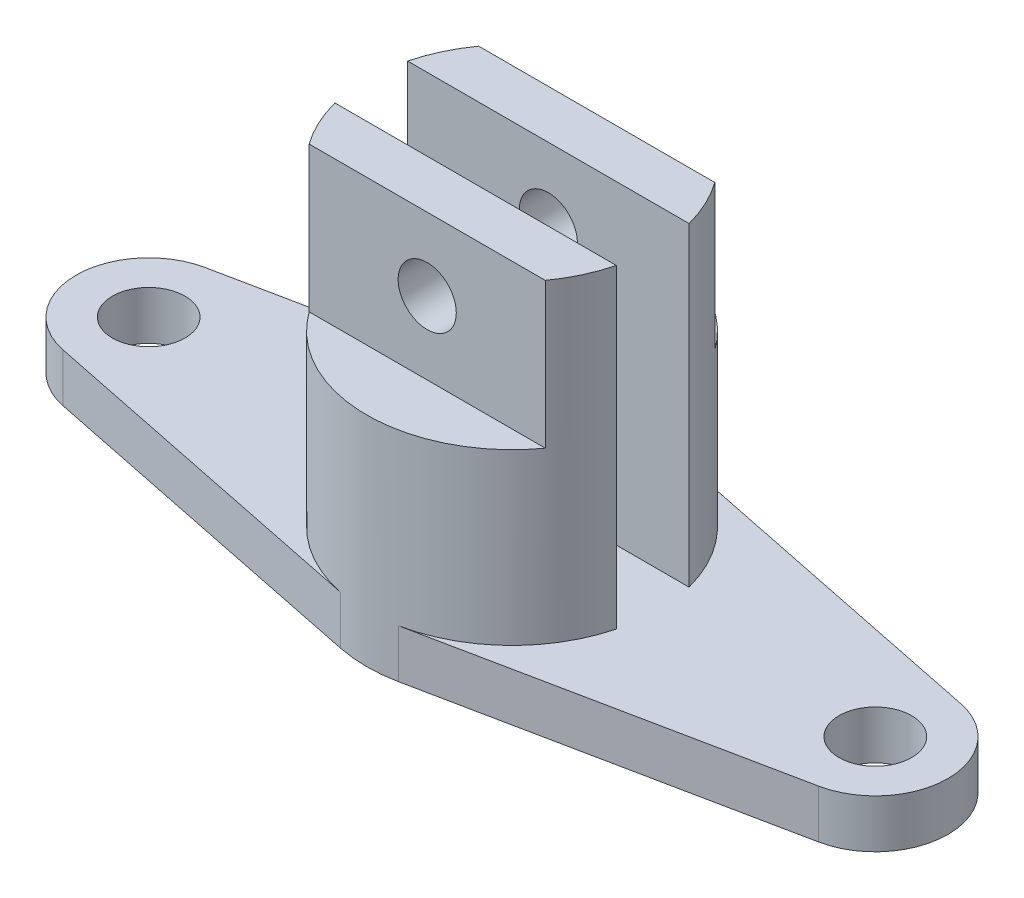
ISO-10303-21;
HEADER;
FILE_DESCRIPTION(('STEP AP214'),'2;1');
FILE_NAME('part.step','',(''),(''),'','','');
FILE_SCHEMA(('AUTOMOTIVE_DESIGN { 1 0 10303 214 1 1 1 1 }'));
ENDSEC;
DATA;
#1=APPLICATION_CONTEXT('core data for automotive mechanical design processes');
#2=APPLICATION_PROTOCOL_DEFINITION('international standard','automotive_design',2000,#1);
#3=PRODUCT_CONTEXT('',#1,'mechanical');
#4=PRODUCT('Part','Part','',(#3));
#5=PRODUCT_RELATED_PRODUCT_CATEGORY('part','',(#4));
#6=PRODUCT_DEFINITION_FORMATION('','',#4);
#7=PRODUCT_DEFINITION_CONTEXT('part definition',#1,'design');
#8=PRODUCT_DEFINITION('design','',#6,#7);
#9=PRODUCT_DEFINITION_SHAPE('','',#8);
#10=(LENGTH_UNIT() NAMED_UNIT(*) SI_UNIT(.MILLI.,.METRE.));
#11=(NAMED_UNIT(*) PLANE_ANGLE_UNIT() SI_UNIT($,.RADIAN.));
#12=(NAMED_UNIT(*) SI_UNIT($,.STERADIAN.) SOLID_ANGLE_UNIT());
#13=UNCERTAINTY_MEASURE_WITH_UNIT(LENGTH_MEASURE(1.E-05),#10,'distance_accuracy_value','');
#14=(GEOMETRIC_REPRESENTATION_CONTEXT(3) GLOBAL_UNCERTAINTY_ASSIGNED_CONTEXT((#13)) GLOBAL_UNIT_ASSIGNED_CONTEXT((#10,
#11,#12)) REPRESENTATION_CONTEXT('',''));
#15=CARTESIAN_POINT('',(0.,0.,0.));
#16=DIRECTION('',(0.,0.,1.));
#17=DIRECTION('',(1.,0.,0.));
#18=AXIS2_PLACEMENT_3D('',#15,#16,#17);
#19=CARTESIAN_POINT('',(0.,1905.,0.));
#20=DIRECTION('',(0.,-1.,0.));
#21=DIRECTION('',(0.,0.,-1.));
#22=AXIS2_PLACEMENT_3D('',#19,#20,#21);
#23=CYLINDRICAL_SURFACE('',#22,762.);
#24=DIRECTION('',(0.,-1.,0.));
#25=VECTOR('',#24,1.);
#26=CARTESIAN_POINT('',(152.4,254.,746.604473600313));
#27=LINE('',#26,#25);
#28=CARTESIAN_POINT('',(152.4,254.,746.604473600313));
#29=VERTEX_POINT('',#28);
#30=CARTESIAN_POINT('',(152.4,0.,746.604473600313));
#31=VERTEX_POINT('',#30);
#32=EDGE_CURVE('E60',#29,#31,#27,.T.);
#33=ORIENTED_EDGE('',*,*,#32,.F.);
#34=CARTESIAN_POINT('',(0.,254.,0.));
#35=DIRECTION('',(0.,1.,0.));
#36=DIRECTION('',(0.,0.,1.));
#37=AXIS2_PLACEMENT_3D('',#34,#35,#36);
#38=CIRCLE('',#37,762.);
#39=CARTESIAN_POINT('',(737.803327452513,254.,190.5));
#40=VERTEX_POINT('',#39);
#41=EDGE_CURVE('E215',#29,#40,#38,.T.);
#42=ORIENTED_EDGE('',*,*,#41,.T.);
#43=DIRECTION('',(0.,-1.,0.));
#44=VECTOR('',#43,1.);
#45=CARTESIAN_POINT('',(737.803327452513,1905.,190.5));
#46=LINE('',#45,#44);
#47=CARTESIAN_POINT('',(737.803327452513,1905.,190.5));
#48=VERTEX_POINT('',#47);
#49=EDGE_CURVE('E53',#48,#40,#46,.T.);
#50=ORIENTED_EDGE('',*,*,#49,.F.);
#51=CARTESIAN_POINT('',(0.,1905.,0.));
#52=DIRECTION('',(0.,1.,0.));
#53=DIRECTION('',(0.,0.,1.));
#54=AXIS2_PLACEMENT_3D('',#51,#52,#53);
#55=CIRCLE('',#54,762.);
#56=CARTESIAN_POINT('',(618.921440895369,1905.,444.5));
#57=VERTEX_POINT('',#56);
#58=EDGE_CURVE('E303',#57,#48,#55,.T.);
#59=ORIENTED_EDGE('',*,*,#58,.F.);
#60=DIRECTION('',(0.,-1.,0.));
#61=VECTOR('',#60,1.);
#62=CARTESIAN_POINT('',(618.921440895369,1905.,444.5));
#63=LINE('',#62,#61);
#64=CARTESIAN_POINT('',(618.921440895369,1143.,444.5));
#65=VERTEX_POINT('',#64);
#66=EDGE_CURVE('E11',#57,#65,#63,.T.);
#67=ORIENTED_EDGE('',*,*,#66,.T.);
#68=CARTESIAN_POINT('',(0.,1143.,0.));
#69=DIRECTION('',(0.,1.,0.));
#70=DIRECTION('',(0.,0.,1.));
#71=AXIS2_PLACEMENT_3D('',#68,#69,#70);
#72=CIRCLE('',#71,762.);
#73=CARTESIAN_POINT('',(-618.921440895369,1143.,444.5));
#74=VERTEX_POINT('',#73);
#75=EDGE_CURVE('E291',#74,#65,#72,.T.);
#76=ORIENTED_EDGE('',*,*,#75,.F.);
#77=DIRECTION('',(0.,-1.,0.));
#78=VECTOR('',#77,1.);
#79=CARTESIAN_POINT('',(-618.921440895369,1905.,444.5));
#80=LINE('',#79,#78);
#81=CARTESIAN_POINT('',(-618.921440895369,1905.,444.5));
#82=VERTEX_POINT('',#81);
#83=EDGE_CURVE('E313',#82,#74,#80,.T.);
#84=ORIENTED_EDGE('',*,*,#83,.F.);
#85=CARTESIAN_POINT('',(-737.803327452513,1905.,190.5));
#86=VERTEX_POINT('',#85);
#87=EDGE_CURVE('E307',#86,#82,#55,.T.);
#88=ORIENTED_EDGE('',*,*,#87,.F.);
#89=DIRECTION('',(0.,-1.,0.));
#90=VECTOR('',#89,1.);
#91=CARTESIAN_POINT('',(-737.803327452513,1905.,190.5));
#92=LINE('',#91,#90);
#93=CARTESIAN_POINT('',(-737.803327452513,254.,190.5));
#94=VERTEX_POINT('',#93);
#95=EDGE_CURVE('E316',#86,#94,#92,.T.);
#96=ORIENTED_EDGE('',*,*,#95,.T.);
#97=CARTESIAN_POINT('',(-152.4,254.,746.604473600313));
#98=VERTEX_POINT('',#97);
#99=EDGE_CURVE('E67',#94,#98,#38,.T.);
#100=ORIENTED_EDGE('',*,*,#99,.T.);
#101=DIRECTION('',(0.,-1.,0.));
#102=VECTOR('',#101,1.);
#103=CARTESIAN_POINT('',(-152.4,254.,746.604473600313));
#104=LINE('',#103,#102);
#105=CARTESIAN_POINT('',(-152.4,0.,746.604473600313));
#106=VERTEX_POINT('',#105);
#107=EDGE_CURVE('E277',#98,#106,#104,.T.);
#108=ORIENTED_EDGE('',*,*,#107,.T.);
#109=CARTESIAN_POINT('',(0.,0.,0.));
#110=DIRECTION('',(0.,1.,0.));
#111=DIRECTION('',(0.,0.,1.));
#112=AXIS2_PLACEMENT_3D('',#109,#110,#111);
#113=CIRCLE('',#112,762.);
#114=EDGE_CURVE('E298',#106,#31,#113,.T.);
#115=ORIENTED_EDGE('',*,*,#114,.T.);
#116=EDGE_LOOP('',(#33,#42,#50,#59,#67,#76,#84,#88,#96,#100,#108,#115));
#117=FACE_BOUND('',#116,.T.);
#118=ADVANCED_FACE('F43',(#117),#23,.T.);
#119=CARTESIAN_POINT('',(0.,1905.,444.5));
#120=DIRECTION('',(0.,0.,-1.));
#121=DIRECTION('',(-1.,0.,0.));
#122=AXIS2_PLACEMENT_3D('',#119,#120,#121);
#123=PLANE('',#122);
#124=CARTESIAN_POINT('',(0.,1524.,444.5));
#125=DIRECTION('',(0.,0.,1.));
#126=DIRECTION('',(1.,0.,0.));
#127=AXIS2_PLACEMENT_3D('',#124,#125,#126);
#128=CIRCLE('',#127,152.4);
#129=CARTESIAN_POINT('',(152.4,1524.,444.5));
#130=VERTEX_POINT('',#129);
#131=EDGE_CURVE('E664',#130,#130,#128,.T.);
#132=ORIENTED_EDGE('',*,*,#131,.F.);
#133=EDGE_LOOP('',(#132));
#134=FACE_BOUND('',#133,.T.);
#135=ORIENTED_EDGE('',*,*,#83,.T.);
#136=DIRECTION('',(1.,0.,0.));
#137=VECTOR('',#136,1.);
#138=CARTESIAN_POINT('',(0.,1143.,444.5));
#139=LINE('',#138,#137);
#140=EDGE_CURVE('E295',#74,#65,#139,.T.);
#141=ORIENTED_EDGE('',*,*,#140,.T.);
#142=ORIENTED_EDGE('',*,*,#66,.F.);
#143=DIRECTION('',(1.,0.,0.));
#144=VECTOR('',#143,1.);
#145=CARTESIAN_POINT('',(0.,1905.,444.5));
#146=LINE('',#145,#144);
#147=EDGE_CURVE('E299',#82,#57,#146,.T.);
#148=ORIENTED_EDGE('',*,*,#147,.F.);
#149=EDGE_LOOP('',(#135,#141,#142,#148));
#150=FACE_BOUND('',#149,.T.);
#151=ADVANCED_FACE('F45',(#134,#150),#123,.F.);
#152=CARTESIAN_POINT('',(0.,1905.,190.5));
#153=DIRECTION('',(0.,0.,-1.));
#154=DIRECTION('',(-1.,0.,0.));
#155=AXIS2_PLACEMENT_3D('',#152,#153,#154);
#156=PLANE('',#155);
#157=CARTESIAN_POINT('',(0.,1524.,190.5));
#158=DIRECTION('',(0.,0.,-1.));
#159=DIRECTION('',(-1.,0.,0.));
#160=AXIS2_PLACEMENT_3D('',#157,#158,#159);
#161=CIRCLE('',#160,152.4);
#162=CARTESIAN_POINT('',(-152.4,1524.,190.5));
#163=VERTEX_POINT('',#162);
#164=EDGE_CURVE('E176',#163,#163,#161,.T.);
#165=ORIENTED_EDGE('',*,*,#164,.F.);
#166=EDGE_LOOP('',(#165));
#167=FACE_BOUND('',#166,.T.);
#168=DIRECTION('',(1.,0.,0.));
#169=VECTOR('',#168,1.);
#170=CARTESIAN_POINT('',(0.,254.,190.5));
#171=LINE('',#170,#169);
#172=EDGE_CURVE('E214',#94,#40,#171,.T.);
#173=ORIENTED_EDGE('',*,*,#172,.F.);
#174=ORIENTED_EDGE('',*,*,#95,.F.);
#175=DIRECTION('',(1.,0.,0.));
#176=VECTOR('',#175,1.);
#177=CARTESIAN_POINT('',(0.,1905.,190.5));
#178=LINE('',#177,#176);
#179=EDGE_CURVE('E306',#86,#48,#178,.T.);
#180=ORIENTED_EDGE('',*,*,#179,.T.);
#181=ORIENTED_EDGE('',*,*,#49,.T.);
#182=EDGE_LOOP('',(#173,#174,#180,#181));
#183=FACE_BOUND('',#182,.T.);
#184=ADVANCED_FACE('F323',(#167,#183),#156,.T.);
#185=CARTESIAN_POINT('',(0.,1905.,0.));
#186=DIRECTION('',(0.,1.,0.));
#187=DIRECTION('',(0.,0.,1.));
#188=AXIS2_PLACEMENT_3D('',#185,#186,#187);
#189=PLANE('',#188);
#190=ORIENTED_EDGE('',*,*,#147,.T.);
#191=ORIENTED_EDGE('',*,*,#58,.T.);
#192=ORIENTED_EDGE('',*,*,#179,.F.);
#193=ORIENTED_EDGE('',*,*,#87,.T.);
#194=EDGE_LOOP('',(#190,#191,#192,#193));
#195=FACE_BOUND('',#194,.T.);
#196=ADVANCED_FACE('F372',(#195),#189,.T.);
#197=CARTESIAN_POINT('',(0.,0.,0.));
#198=DIRECTION('',(0.,1.,0.));
#199=DIRECTION('',(0.,0.,1.));
#200=AXIS2_PLACEMENT_3D('',#197,#198,#199);
#201=PLANE('',#200);
#202=CARTESIAN_POINT('',(0.,0.,0.));
#203=DIRECTION('',(0.,1.,0.));
#204=DIRECTION('',(0.,0.,1.));
#205=AXIS2_PLACEMENT_3D('',#202,#203,#204);
#206=CIRCLE('',#205,762.);
#207=CARTESIAN_POINT('',(152.4,0.,-746.604473600313));
#208=VERTEX_POINT('',#207);
#209=CARTESIAN_POINT('',(-152.4,0.,-746.604473600312));
#210=VERTEX_POINT('',#209);
#211=EDGE_CURVE('E170',#208,#210,#206,.T.);
#212=ORIENTED_EDGE('',*,*,#211,.F.);
#213=DIRECTION('',(0.979795897113271,0.,0.199999999999999));
#214=VECTOR('',#213,1.);
#215=CARTESIAN_POINT('',(152.4,0.,-746.604473600313));
#216=LINE('',#215,#214);
#217=CARTESIAN_POINT('',(1981.2,0.,-373.302236800158));
#218=VERTEX_POINT('',#217);
#219=EDGE_CURVE('E254',#208,#218,#216,.T.);
#220=ORIENTED_EDGE('',*,*,#219,.T.);
#221=CARTESIAN_POINT('',(1905.,0.,0.));
#222=DIRECTION('',(0.,1.,0.));
#223=DIRECTION('',(0.,0.,1.));
#224=AXIS2_PLACEMENT_3D('',#221,#222,#223);
#225=CIRCLE('',#224,381.000000000001);
#226=CARTESIAN_POINT('',(1981.2,0.,373.302236800156));
#227=VERTEX_POINT('',#226);
#228=EDGE_CURVE('E250',#227,#218,#225,.T.);
#229=ORIENTED_EDGE('',*,*,#228,.F.);
#230=DIRECTION('',(0.979795897113271,0.,-0.2));
#231=VECTOR('',#230,1.);
#232=CARTESIAN_POINT('',(152.4,0.,746.604473600313));
#233=LINE('',#232,#231);
#234=EDGE_CURVE('E247',#31,#227,#233,.T.);
#235=ORIENTED_EDGE('',*,*,#234,.F.);
#236=ORIENTED_EDGE('',*,*,#114,.F.);
#237=DIRECTION('',(0.979795897113271,0.,0.2));
#238=VECTOR('',#237,1.);
#239=CARTESIAN_POINT('',(-152.4,0.,746.604473600313));
#240=LINE('',#239,#238);
#241=CARTESIAN_POINT('',(-1981.2,0.,373.302236800156));
#242=VERTEX_POINT('',#241);
#243=EDGE_CURVE('E243',#242,#106,#240,.T.);
#244=ORIENTED_EDGE('',*,*,#243,.F.);
#245=CARTESIAN_POINT('',(-1905.,0.,0.));
#246=DIRECTION('',(0.,1.,0.));
#247=DIRECTION('',(0.,0.,1.));
#248=AXIS2_PLACEMENT_3D('',#245,#246,#247);
#249=CIRCLE('',#248,381.);
#250=CARTESIAN_POINT('',(-1981.2,0.,-373.302236800156));
#251=VERTEX_POINT('',#250);
#252=EDGE_CURVE('E240',#251,#242,#249,.T.);
#253=ORIENTED_EDGE('',*,*,#252,.F.);
#254=DIRECTION('',(-0.979795897113271,0.,0.2));
#255=VECTOR('',#254,1.);
#256=CARTESIAN_POINT('',(-152.4,0.,-746.604473600312));
#257=LINE('',#256,#255);
#258=EDGE_CURVE('E187',#210,#251,#257,.T.);
#259=ORIENTED_EDGE('',*,*,#258,.F.);
#260=EDGE_LOOP('',(#212,#220,#229,#235,#236,#244,#253,#259));
#261=FACE_BOUND('',#260,.T.);
#262=CARTESIAN_POINT('',(-1905.,0.,0.));
#263=DIRECTION('',(0.,1.,0.));
#264=DIRECTION('',(0.,0.,1.));
#265=AXIS2_PLACEMENT_3D('',#262,#263,#264);
#266=CIRCLE('',#265,190.5);
#267=CARTESIAN_POINT('',(-1905.,0.,190.5));
#268=VERTEX_POINT('',#267);
#269=EDGE_CURVE('E258',#268,#268,#266,.T.);
#270=ORIENTED_EDGE('',*,*,#269,.T.);
#271=EDGE_LOOP('',(#270));
#272=FACE_BOUND('',#271,.T.);
#273=CARTESIAN_POINT('',(1905.,0.,0.));
#274=DIRECTION('',(0.,1.,0.));
#275=DIRECTION('',(0.,0.,1.));
#276=AXIS2_PLACEMENT_3D('',#273,#274,#275);
#277=CIRCLE('',#276,190.499999999998);
#278=CARTESIAN_POINT('',(1905.,0.,190.499999999998));
#279=VERTEX_POINT('',#278);
#280=EDGE_CURVE('E198',#279,#279,#277,.T.);
#281=ORIENTED_EDGE('',*,*,#280,.T.);
#282=EDGE_LOOP('',(#281));
#283=FACE_BOUND('',#282,.T.);
#284=ADVANCED_FACE('F340',(#261,#272,#283),#201,.F.);
#285=CARTESIAN_POINT('',(0.,1143.,0.));
#286=DIRECTION('',(0.,1.,0.));
#287=DIRECTION('',(0.,0.,1.));
#288=AXIS2_PLACEMENT_3D('',#285,#286,#287);
#289=PLANE('',#288);
#290=ORIENTED_EDGE('',*,*,#75,.T.);
#291=ORIENTED_EDGE('',*,*,#140,.F.);
#292=EDGE_LOOP('',(#290,#291));
#293=FACE_BOUND('',#292,.T.);
#294=ADVANCED_FACE('F379',(#293),#289,.T.);
#295=CARTESIAN_POINT('',(-152.4,254.,-746.604473600312));
#296=DIRECTION('',(0.2,0.,0.979795897113271));
#297=DIRECTION('',(0.979795897113271,0.,-0.2));
#298=AXIS2_PLACEMENT_3D('',#295,#296,#297);
#299=PLANE('',#298);
#300=ORIENTED_EDGE('',*,*,#258,.T.);
#301=DIRECTION('',(0.,-1.,0.));
#302=VECTOR('',#301,1.);
#303=CARTESIAN_POINT('',(-1981.2,254.,-373.302236800156));
#304=LINE('',#303,#302);
#305=CARTESIAN_POINT('',(-1981.2,254.,-373.302236800156));
#306=VERTEX_POINT('',#305);
#307=EDGE_CURVE('E284',#306,#251,#304,.T.);
#308=ORIENTED_EDGE('',*,*,#307,.F.);
#309=DIRECTION('',(-0.979795897113271,0.,0.2));
#310=VECTOR('',#309,1.);
#311=CARTESIAN_POINT('',(-152.4,254.,-746.604473600312));
#312=LINE('',#311,#310);
#313=CARTESIAN_POINT('',(-152.4,254.,-746.604473600312));
#314=VERTEX_POINT('',#313);
#315=EDGE_CURVE('E203',#314,#306,#312,.T.);
#316=ORIENTED_EDGE('',*,*,#315,.F.);
#317=DIRECTION('',(0.,-1.,0.));
#318=VECTOR('',#317,1.);
#319=CARTESIAN_POINT('',(-152.4,254.,-746.604473600312));
#320=LINE('',#319,#318);
#321=EDGE_CURVE('E288',#314,#210,#320,.T.);
#322=ORIENTED_EDGE('',*,*,#321,.T.);
#323=EDGE_LOOP('',(#300,#308,#316,#322));
#324=FACE_BOUND('',#323,.T.);
#325=ADVANCED_FACE('F381',(#324),#299,.F.);
#326=CARTESIAN_POINT('',(-1905.,254.,0.));
#327=DIRECTION('',(0.,-1.,0.));
#328=DIRECTION('',(0.,0.,-1.));
#329=AXIS2_PLACEMENT_3D('',#326,#327,#328);
#330=CYLINDRICAL_SURFACE('',#329,381.);
#331=ORIENTED_EDGE('',*,*,#252,.T.);
#332=DIRECTION('',(0.,-1.,0.));
#333=VECTOR('',#332,1.);
#334=CARTESIAN_POINT('',(-1981.2,254.,373.302236800156));
#335=LINE('',#334,#333);
#336=CARTESIAN_POINT('',(-1981.2,254.,373.302236800156));
#337=VERTEX_POINT('',#336);
#338=EDGE_CURVE('E280',#337,#242,#335,.T.);
#339=ORIENTED_EDGE('',*,*,#338,.F.);
#340=CARTESIAN_POINT('',(-1905.,254.,0.));
#341=DIRECTION('',(0.,1.,0.));
#342=DIRECTION('',(0.,0.,1.));
#343=AXIS2_PLACEMENT_3D('',#340,#341,#342);
#344=CIRCLE('',#343,381.);
#345=EDGE_CURVE('E206',#306,#337,#344,.T.);
#346=ORIENTED_EDGE('',*,*,#345,.F.);
#347=ORIENTED_EDGE('',*,*,#307,.T.);
#348=EDGE_LOOP('',(#331,#339,#346,#347));
#349=FACE_BOUND('',#348,.T.);
#350=ADVANCED_FACE('F387',(#349),#330,.T.);
#351=CARTESIAN_POINT('',(-152.4,254.,746.604473600313));
#352=DIRECTION('',(0.2,0.,-0.979795897113271));
#353=DIRECTION('',(-0.979795897113271,0.,-0.2));
#354=AXIS2_PLACEMENT_3D('',#351,#352,#353);
#355=PLANE('',#354);
#356=ORIENTED_EDGE('',*,*,#243,.T.);
#357=ORIENTED_EDGE('',*,*,#107,.F.);
#358=DIRECTION('',(0.979795897113271,0.,0.2));
#359=VECTOR('',#358,1.);
#360=CARTESIAN_POINT('',(-152.4,254.,746.604473600313));
#361=LINE('',#360,#359);
#362=EDGE_CURVE('E209',#337,#98,#361,.T.);
#363=ORIENTED_EDGE('',*,*,#362,.F.);
#364=ORIENTED_EDGE('',*,*,#338,.T.);
#365=EDGE_LOOP('',(#356,#357,#363,#364));
#366=FACE_BOUND('',#365,.T.);
#367=ADVANCED_FACE('F334',(#366),#355,.F.);
#368=CARTESIAN_POINT('',(152.4,254.,746.604473600313));
#369=DIRECTION('',(-0.2,0.,-0.979795897113271));
#370=DIRECTION('',(-0.979795897113271,0.,0.2));
#371=AXIS2_PLACEMENT_3D('',#368,#369,#370);
#372=PLANE('',#371);
#373=ORIENTED_EDGE('',*,*,#234,.T.);
#374=DIRECTION('',(0.,-1.,0.));
#375=VECTOR('',#374,1.);
#376=CARTESIAN_POINT('',(1981.2,254.,373.302236800156));
#377=LINE('',#376,#375);
#378=CARTESIAN_POINT('',(1981.2,254.,373.302236800156));
#379=VERTEX_POINT('',#378);
#380=EDGE_CURVE('E271',#379,#227,#377,.T.);
#381=ORIENTED_EDGE('',*,*,#380,.F.);
#382=DIRECTION('',(0.979795897113271,0.,-0.2));
#383=VECTOR('',#382,1.);
#384=CARTESIAN_POINT('',(152.4,254.,746.604473600313));
#385=LINE('',#384,#383);
#386=EDGE_CURVE('E219',#29,#379,#385,.T.);
#387=ORIENTED_EDGE('',*,*,#386,.F.);
#388=ORIENTED_EDGE('',*,*,#32,.T.);
#389=EDGE_LOOP('',(#373,#381,#387,#388));
#390=FACE_BOUND('',#389,.T.);
#391=ADVANCED_FACE('F346',(#390),#372,.F.);
#392=CARTESIAN_POINT('',(1905.,254.,0.));
#393=DIRECTION('',(0.,-1.,0.));
#394=DIRECTION('',(0.,0.,-1.));
#395=AXIS2_PLACEMENT_3D('',#392,#393,#394);
#396=CYLINDRICAL_SURFACE('',#395,381.000000000001);
#397=ORIENTED_EDGE('',*,*,#228,.T.);
#398=DIRECTION('',(0.,-1.,0.));
#399=VECTOR('',#398,1.);
#400=CARTESIAN_POINT('',(1981.2,254.,-373.302236800158));
#401=LINE('',#400,#399);
#402=CARTESIAN_POINT('',(1981.2,254.,-373.302236800158));
#403=VERTEX_POINT('',#402);
#404=EDGE_CURVE('E268',#403,#218,#401,.T.);
#405=ORIENTED_EDGE('',*,*,#404,.F.);
#406=CARTESIAN_POINT('',(1905.,254.,0.));
#407=DIRECTION('',(0.,1.,0.));
#408=DIRECTION('',(0.,0.,1.));
#409=AXIS2_PLACEMENT_3D('',#406,#407,#408);
#410=CIRCLE('',#409,381.000000000001);
#411=EDGE_CURVE('E222',#379,#403,#410,.T.);
#412=ORIENTED_EDGE('',*,*,#411,.F.);
#413=ORIENTED_EDGE('',*,*,#380,.T.);
#414=EDGE_LOOP('',(#397,#405,#412,#413));
#415=FACE_BOUND('',#414,.T.);
#416=ADVANCED_FACE('F349',(#415),#396,.T.);
#417=CARTESIAN_POINT('',(-1905.,254.,0.));
#418=DIRECTION('',(0.,-1.,0.));
#419=DIRECTION('',(0.,0.,-1.));
#420=AXIS2_PLACEMENT_3D('',#417,#418,#419);
#421=CYLINDRICAL_SURFACE('',#420,190.5);
#422=CARTESIAN_POINT('',(-1905.,254.,0.));
#423=DIRECTION('',(0.,1.,0.));
#424=DIRECTION('',(0.,0.,1.));
#425=AXIS2_PLACEMENT_3D('',#422,#423,#424);
#426=CIRCLE('',#425,190.5);
#427=CARTESIAN_POINT('',(-1905.,254.,190.5));
#428=VERTEX_POINT('',#427);
#429=EDGE_CURVE('E229',#428,#428,#426,.T.);
#430=ORIENTED_EDGE('',*,*,#429,.T.);
#431=EDGE_LOOP('',(#430));
#432=FACE_BOUND('',#431,.T.);
#433=ORIENTED_EDGE('',*,*,#269,.F.);
#434=EDGE_LOOP('',(#433));
#435=FACE_BOUND('',#434,.T.);
#436=ADVANCED_FACE('F449',(#432,#435),#421,.F.);
#437=CARTESIAN_POINT('',(152.4,254.,-746.604473600313));
#438=DIRECTION('',(0.199999999999999,0.,-0.979795897113271));
#439=DIRECTION('',(-0.979795897113271,0.,-0.199999999999999));
#440=AXIS2_PLACEMENT_3D('',#437,#438,#439);
#441=PLANE('',#440);
#442=ORIENTED_EDGE('',*,*,#219,.F.);
#443=DIRECTION('',(0.,-1.,0.));
#444=VECTOR('',#443,1.);
#445=CARTESIAN_POINT('',(152.4,254.,-746.604473600313));
#446=LINE('',#445,#444);
#447=CARTESIAN_POINT('',(152.399999999999,254.,-746.604473600313));
#448=VERTEX_POINT('',#447);
#449=EDGE_CURVE('E237',#448,#208,#446,.T.);
#450=ORIENTED_EDGE('',*,*,#449,.F.);
#451=DIRECTION('',(0.979795897113271,0.,0.199999999999999));
#452=VECTOR('',#451,1.);
#453=CARTESIAN_POINT('',(152.4,254.,-746.604473600313));
#454=LINE('',#453,#452);
#455=EDGE_CURVE('E225',#448,#403,#454,.T.);
#456=ORIENTED_EDGE('',*,*,#455,.T.);
#457=ORIENTED_EDGE('',*,*,#404,.T.);
#458=EDGE_LOOP('',(#442,#450,#456,#457));
#459=FACE_BOUND('',#458,.T.);
#460=ADVANCED_FACE('F353',(#459),#441,.T.);
#461=CARTESIAN_POINT('',(1905.,254.,0.));
#462=DIRECTION('',(0.,-1.,0.));
#463=DIRECTION('',(0.,0.,-1.));
#464=AXIS2_PLACEMENT_3D('',#461,#462,#463);
#465=CYLINDRICAL_SURFACE('',#464,190.499999999998);
#466=CARTESIAN_POINT('',(1905.,254.,0.));
#467=DIRECTION('',(0.,1.,0.));
#468=DIRECTION('',(0.,0.,1.));
#469=AXIS2_PLACEMENT_3D('',#466,#467,#468);
#470=CIRCLE('',#469,190.499999999998);
#471=CARTESIAN_POINT('',(1905.,254.,190.499999999998));
#472=VERTEX_POINT('',#471);
#473=EDGE_CURVE('E233',#472,#472,#470,.T.);
#474=ORIENTED_EDGE('',*,*,#473,.T.);
#475=EDGE_LOOP('',(#474));
#476=FACE_BOUND('',#475,.T.);
#477=ORIENTED_EDGE('',*,*,#280,.F.);
#478=EDGE_LOOP('',(#477));
#479=FACE_BOUND('',#478,.T.);
#480=ADVANCED_FACE('F445',(#476,#479),#465,.F.);
#481=CARTESIAN_POINT('',(0.,254.,0.));
#482=DIRECTION('',(0.,1.,0.));
#483=DIRECTION('',(0.,0.,1.));
#484=AXIS2_PLACEMENT_3D('',#481,#482,#483);
#485=PLANE('',#484);
#486=CARTESIAN_POINT('',(0.,254.,0.));
#487=DIRECTION('',(0.,1.,0.));
#488=DIRECTION('',(0.,0.,1.));
#489=AXIS2_PLACEMENT_3D('',#486,#487,#488);
#490=CIRCLE('',#489,762.);
#491=CARTESIAN_POINT('',(737.803327452513,254.,-190.5));
#492=VERTEX_POINT('',#491);
#493=EDGE_CURVE('E193',#492,#448,#490,.T.);
#494=ORIENTED_EDGE('',*,*,#493,.F.);
#495=DIRECTION('',(1.,0.,0.));
#496=VECTOR('',#495,1.);
#497=CARTESIAN_POINT('',(0.,254.,-190.5));
#498=LINE('',#497,#496);
#499=CARTESIAN_POINT('',(-737.803327452513,254.,-190.5));
#500=VERTEX_POINT('',#499);
#501=EDGE_CURVE('E197',#500,#492,#498,.T.);
#502=ORIENTED_EDGE('',*,*,#501,.F.);
#503=EDGE_CURVE('E199',#314,#500,#490,.T.);
#504=ORIENTED_EDGE('',*,*,#503,.F.);
#505=ORIENTED_EDGE('',*,*,#315,.T.);
#506=ORIENTED_EDGE('',*,*,#345,.T.);
#507=ORIENTED_EDGE('',*,*,#362,.T.);
#508=ORIENTED_EDGE('',*,*,#99,.F.);
#509=ORIENTED_EDGE('',*,*,#172,.T.);
#510=ORIENTED_EDGE('',*,*,#41,.F.);
#511=ORIENTED_EDGE('',*,*,#386,.T.);
#512=ORIENTED_EDGE('',*,*,#411,.T.);
#513=ORIENTED_EDGE('',*,*,#455,.F.);
#514=EDGE_LOOP('',(#494,#502,#504,#505,#506,#507,#508,#509,#510,#511,#512,#513));
#515=FACE_BOUND('',#514,.T.);
#516=ORIENTED_EDGE('',*,*,#429,.F.);
#517=EDGE_LOOP('',(#516));
#518=FACE_BOUND('',#517,.T.);
#519=ORIENTED_EDGE('',*,*,#473,.F.);
#520=EDGE_LOOP('',(#519));
#521=FACE_BOUND('',#520,.T.);
#522=ADVANCED_FACE('F327',(#515,#518,#521),#485,.T.);
#523=CARTESIAN_POINT('',(0.,1905.,0.));
#524=DIRECTION('',(0.,-1.,0.));
#525=DIRECTION('',(0.,0.,-1.));
#526=AXIS2_PLACEMENT_3D('',#523,#524,#525);
#527=CYLINDRICAL_SURFACE('',#526,762.);
#528=ORIENTED_EDGE('',*,*,#211,.T.);
#529=ORIENTED_EDGE('',*,*,#321,.F.);
#530=ORIENTED_EDGE('',*,*,#503,.T.);
#531=DIRECTION('',(0.,-1.,0.));
#532=VECTOR('',#531,1.);
#533=CARTESIAN_POINT('',(-737.803327452513,1905.,-190.5));
#534=LINE('',#533,#532);
#535=CARTESIAN_POINT('',(-737.803327452513,1905.,-190.5));
#536=VERTEX_POINT('',#535);
#537=EDGE_CURVE('E189',#536,#500,#534,.T.);
#538=ORIENTED_EDGE('',*,*,#537,.F.);
#539=CARTESIAN_POINT('',(0.,1905.,0.));
#540=DIRECTION('',(0.,1.,0.));
#541=DIRECTION('',(0.,0.,1.));
#542=AXIS2_PLACEMENT_3D('',#539,#540,#541);
#543=CIRCLE('',#542,762.);
#544=CARTESIAN_POINT('',(-618.921440895369,1905.,-444.5));
#545=VERTEX_POINT('',#544);
#546=EDGE_CURVE('E418',#545,#536,#543,.T.);
#547=ORIENTED_EDGE('',*,*,#546,.F.);
#548=DIRECTION('',(0.,-1.,0.));
#549=VECTOR('',#548,1.);
#550=CARTESIAN_POINT('',(-618.921440895369,1905.,-444.5));
#551=LINE('',#550,#549);
#552=CARTESIAN_POINT('',(-618.921440895369,1143.,-444.5));
#553=VERTEX_POINT('',#552);
#554=EDGE_CURVE('E166',#545,#553,#551,.T.);
#555=ORIENTED_EDGE('',*,*,#554,.T.);
#556=CARTESIAN_POINT('',(0.,1143.,0.));
#557=DIRECTION('',(0.,1.,0.));
#558=DIRECTION('',(0.,0.,1.));
#559=AXIS2_PLACEMENT_3D('',#556,#557,#558);
#560=CIRCLE('',#559,762.);
#561=CARTESIAN_POINT('',(618.921440895369,1143.,-444.5));
#562=VERTEX_POINT('',#561);
#563=EDGE_CURVE('E158',#562,#553,#560,.T.);
#564=ORIENTED_EDGE('',*,*,#563,.F.);
#565=DIRECTION('',(0.,-1.,0.));
#566=VECTOR('',#565,1.);
#567=CARTESIAN_POINT('',(618.921440895369,1905.,-444.5));
#568=LINE('',#567,#566);
#569=CARTESIAN_POINT('',(618.921440895369,1905.,-444.5));
#570=VERTEX_POINT('',#569);
#571=EDGE_CURVE('E163',#570,#562,#568,.T.);
#572=ORIENTED_EDGE('',*,*,#571,.F.);
#573=CARTESIAN_POINT('',(737.803327452513,1905.,-190.5));
#574=VERTEX_POINT('',#573);
#575=EDGE_CURVE('E355',#574,#570,#543,.T.);
#576=ORIENTED_EDGE('',*,*,#575,.F.);
#577=DIRECTION('',(0.,-1.,0.));
#578=VECTOR('',#577,1.);
#579=CARTESIAN_POINT('',(737.803327452513,1905.,-190.5));
#580=LINE('',#579,#578);
#581=EDGE_CURVE('E182',#574,#492,#580,.T.);
#582=ORIENTED_EDGE('',*,*,#581,.T.);
#583=ORIENTED_EDGE('',*,*,#493,.T.);
#584=ORIENTED_EDGE('',*,*,#449,.T.);
#585=EDGE_LOOP('',(#528,#529,#530,#538,#547,#555,#564,#572,#576,#582,#583,#584));
#586=FACE_BOUND('',#585,.T.);
#587=ADVANCED_FACE('F161',(#586),#527,.T.);
#588=CARTESIAN_POINT('',(0.,1905.,-190.5));
#589=DIRECTION('',(0.,0.,-1.));
#590=DIRECTION('',(-1.,0.,0.));
#591=AXIS2_PLACEMENT_3D('',#588,#589,#590);
#592=PLANE('',#591);
#593=CARTESIAN_POINT('',(0.,1524.,-190.5));
#594=DIRECTION('',(0.,0.,-1.));
#595=DIRECTION('',(-1.,0.,0.));
#596=AXIS2_PLACEMENT_3D('',#593,#594,#595);
#597=CIRCLE('',#596,152.4);
#598=CARTESIAN_POINT('',(-152.4,1524.,-190.5));
#599=VERTEX_POINT('',#598);
#600=EDGE_CURVE('E407',#599,#599,#597,.T.);
#601=ORIENTED_EDGE('',*,*,#600,.T.);
#602=EDGE_LOOP('',(#601));
#603=FACE_BOUND('',#602,.T.);
#604=ORIENTED_EDGE('',*,*,#501,.T.);
#605=ORIENTED_EDGE('',*,*,#581,.F.);
#606=DIRECTION('',(1.,0.,0.));
#607=VECTOR('',#606,1.);
#608=CARTESIAN_POINT('',(0.,1905.,-190.5));
#609=LINE('',#608,#607);
#610=EDGE_CURVE('E361',#536,#574,#609,.T.);
#611=ORIENTED_EDGE('',*,*,#610,.F.);
#612=ORIENTED_EDGE('',*,*,#537,.T.);
#613=EDGE_LOOP('',(#604,#605,#611,#612));
#614=FACE_BOUND('',#613,.T.);
#615=ADVANCED_FACE('F359',(#603,#614),#592,.F.);
#616=CARTESIAN_POINT('',(0.,1905.,-444.5));
#617=DIRECTION('',(0.,0.,-1.));
#618=DIRECTION('',(-1.,0.,0.));
#619=AXIS2_PLACEMENT_3D('',#616,#617,#618);
#620=PLANE('',#619);
#621=CARTESIAN_POINT('',(0.,1524.,-444.5));
#622=DIRECTION('',(0.,0.,-1.));
#623=DIRECTION('',(-1.,0.,0.));
#624=AXIS2_PLACEMENT_3D('',#621,#622,#623);
#625=CIRCLE('',#624,152.4);
#626=CARTESIAN_POINT('',(-152.4,1524.,-444.5));
#627=VERTEX_POINT('',#626);
#628=EDGE_CURVE('E47',#627,#627,#625,.T.);
#629=ORIENTED_EDGE('',*,*,#628,.F.);
#630=EDGE_LOOP('',(#629));
#631=FACE_BOUND('',#630,.T.);
#632=DIRECTION('',(1.,0.,0.));
#633=VECTOR('',#632,1.);
#634=CARTESIAN_POINT('',(0.,1143.,-444.5));
#635=LINE('',#634,#633);
#636=EDGE_CURVE('E171',#553,#562,#635,.T.);
#637=ORIENTED_EDGE('',*,*,#636,.F.);
#638=ORIENTED_EDGE('',*,*,#554,.F.);
#639=DIRECTION('',(1.,0.,0.));
#640=VECTOR('',#639,1.);
#641=CARTESIAN_POINT('',(0.,1905.,-444.5));
#642=LINE('',#641,#640);
#643=EDGE_CURVE('E180',#545,#570,#642,.T.);
#644=ORIENTED_EDGE('',*,*,#643,.T.);
#645=ORIENTED_EDGE('',*,*,#571,.T.);
#646=EDGE_LOOP('',(#637,#638,#644,#645));
#647=FACE_BOUND('',#646,.T.);
#648=ADVANCED_FACE('F178',(#631,#647),#620,.T.);
#649=CARTESIAN_POINT('',(0.,1905.,0.));
#650=DIRECTION('',(0.,1.,0.));
#651=DIRECTION('',(0.,0.,1.));
#652=AXIS2_PLACEMENT_3D('',#649,#650,#651);
#653=PLANE('',#652);
#654=ORIENTED_EDGE('',*,*,#610,.T.);
#655=ORIENTED_EDGE('',*,*,#575,.T.);
#656=ORIENTED_EDGE('',*,*,#643,.F.);
#657=ORIENTED_EDGE('',*,*,#546,.T.);
#658=EDGE_LOOP('',(#654,#655,#656,#657));
#659=FACE_BOUND('',#658,.T.);
#660=ADVANCED_FACE('F425',(#659),#653,.T.);
#661=CARTESIAN_POINT('',(0.,1143.,0.));
#662=DIRECTION('',(0.,1.,0.));
#663=DIRECTION('',(0.,0.,1.));
#664=AXIS2_PLACEMENT_3D('',#661,#662,#663);
#665=PLANE('',#664);
#666=ORIENTED_EDGE('',*,*,#636,.T.);
#667=ORIENTED_EDGE('',*,*,#563,.T.);
#668=EDGE_LOOP('',(#666,#667));
#669=FACE_BOUND('',#668,.T.);
#670=ADVANCED_FACE('F173',(#669),#665,.T.);
#671=CARTESIAN_POINT('',(0.,1524.,-820.42));
#672=DIRECTION('',(0.,0.,1.));
#673=DIRECTION('',(1.,0.,0.));
#674=AXIS2_PLACEMENT_3D('',#671,#672,#673);
#675=CYLINDRICAL_SURFACE('',#674,152.4);
#676=ORIENTED_EDGE('',*,*,#628,.T.);
#677=EDGE_LOOP('',(#676));
#678=FACE_BOUND('',#677,.T.);
#679=ORIENTED_EDGE('',*,*,#600,.F.);
#680=EDGE_LOOP('',(#679));
#681=FACE_BOUND('',#680,.T.);
#682=ADVANCED_FACE('F432',(#678,#681),#675,.F.);
#683=ORIENTED_EDGE('',*,*,#164,.T.);
#684=EDGE_LOOP('',(#683));
#685=FACE_BOUND('',#684,.T.);
#686=ORIENTED_EDGE('',*,*,#131,.T.);
#687=EDGE_LOOP('',(#686));
#688=FACE_BOUND('',#687,.T.);
#689=ADVANCED_FACE('F519',(#685,#688),#675,.F.);
#690=CLOSED_SHELL('',(#118,#151,#184,#196,#284,#294,#325,#350,#367,#391,#416,#436,#460,#480,
#522,#587,#615,#648,#660,#670,#682,#689));
#691=MANIFOLD_SOLID_BREP('B2',#690);
#692=ADVANCED_BREP_SHAPE_REPRESENTATION('',(#18,#691),#14);
#693=SHAPE_DEFINITION_REPRESENTATION(#9,#692);
ENDSEC;
END-ISO-10303-21;
